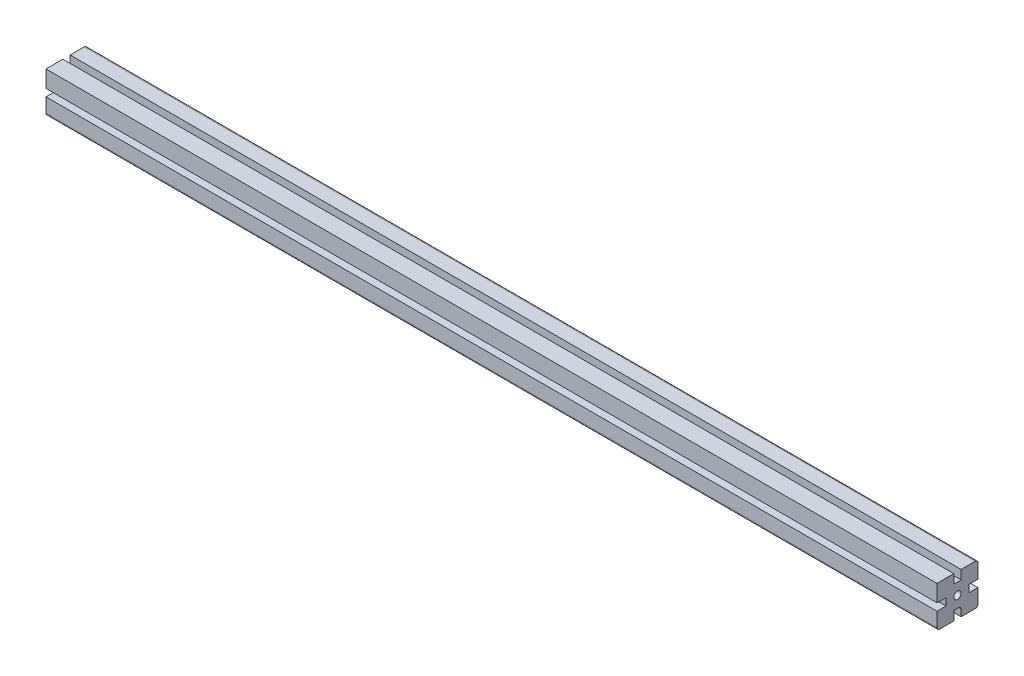
ISO-10303-21;
HEADER;
FILE_DESCRIPTION(('STEP AP214'),'2;1');
FILE_NAME('part.step','',(''),(''),'','','');
FILE_SCHEMA(('AUTOMOTIVE_DESIGN { 1 0 10303 214 1 1 1 1 }'));
ENDSEC;
DATA;
#1=APPLICATION_CONTEXT('core data for automotive mechanical design processes');
#2=APPLICATION_PROTOCOL_DEFINITION('international standard','automotive_design',2000,#1);
#3=PRODUCT_CONTEXT('',#1,'mechanical');
#4=PRODUCT('Part','Part','',(#3));
#5=PRODUCT_RELATED_PRODUCT_CATEGORY('part','',(#4));
#6=PRODUCT_DEFINITION_FORMATION('','',#4);
#7=PRODUCT_DEFINITION_CONTEXT('part definition',#1,'design');
#8=PRODUCT_DEFINITION('design','',#6,#7);
#9=PRODUCT_DEFINITION_SHAPE('','',#8);
#10=(LENGTH_UNIT() NAMED_UNIT(*) SI_UNIT(.MILLI.,.METRE.));
#11=(NAMED_UNIT(*) PLANE_ANGLE_UNIT() SI_UNIT($,.RADIAN.));
#12=(NAMED_UNIT(*) SI_UNIT($,.STERADIAN.) SOLID_ANGLE_UNIT());
#13=UNCERTAINTY_MEASURE_WITH_UNIT(LENGTH_MEASURE(1.E-05),#10,'distance_accuracy_value','');
#14=(GEOMETRIC_REPRESENTATION_CONTEXT(3) GLOBAL_UNCERTAINTY_ASSIGNED_CONTEXT((#13)) GLOBAL_UNIT_ASSIGNED_CONTEXT((#10,
#11,#12)) REPRESENTATION_CONTEXT('',''));
#15=CARTESIAN_POINT('',(0.,0.,0.));
#16=DIRECTION('',(0.,0.,1.));
#17=DIRECTION('',(1.,0.,0.));
#18=AXIS2_PLACEMENT_3D('',#15,#16,#17);
#19=CARTESIAN_POINT('',(22.,-22.5,-22.5));
#20=DIRECTION('',(0.,0.,-1.));
#21=DIRECTION('',(0.,1.,0.));
#22=AXIS2_PLACEMENT_3D('',#19,#20,#21);
#23=PLANE('',#22);
#24=DIRECTION('',(0.,1.,0.));
#25=VECTOR('',#24,1.);
#26=CARTESIAN_POINT('',(1000.,-22.5,-22.5));
#27=LINE('',#26,#25);
#28=CARTESIAN_POINT('',(1000.,-19.5,-22.5));
#29=VERTEX_POINT('',#28);
#30=CARTESIAN_POINT('',(1000.,-4.,-22.5));
#31=VERTEX_POINT('',#30);
#32=EDGE_CURVE('E270',#29,#31,#27,.T.);
#33=ORIENTED_EDGE('',*,*,#32,.F.);
#34=DIRECTION('',(1.,0.,0.));
#35=VECTOR('',#34,1.);
#36=CARTESIAN_POINT('',(22.,-19.5,-22.5));
#37=LINE('',#36,#35);
#38=CARTESIAN_POINT('',(22.,-19.5,-22.5));
#39=VERTEX_POINT('',#38);
#40=EDGE_CURVE('E201',#29,#39,#37,.F.);
#41=ORIENTED_EDGE('',*,*,#40,.T.);
#42=DIRECTION('',(0.,1.,0.));
#43=VECTOR('',#42,1.);
#44=CARTESIAN_POINT('',(22.,-22.5,-22.5));
#45=LINE('',#44,#43);
#46=CARTESIAN_POINT('',(22.,-4.,-22.5));
#47=VERTEX_POINT('',#46);
#48=EDGE_CURVE('E195',#39,#47,#45,.T.);
#49=ORIENTED_EDGE('',*,*,#48,.T.);
#50=DIRECTION('',(1.,0.,0.));
#51=VECTOR('',#50,1.);
#52=CARTESIAN_POINT('',(22.,-4.,-22.5));
#53=LINE('',#52,#51);
#54=EDGE_CURVE('E198',#47,#31,#53,.T.);
#55=ORIENTED_EDGE('',*,*,#54,.T.);
#56=EDGE_LOOP('',(#33,#41,#49,#55));
#57=FACE_BOUND('',#56,.T.);
#58=ADVANCED_FACE('F33',(#57),#23,.T.);
#59=CARTESIAN_POINT('',(22.,-22.5,-4.00000000000001));
#60=DIRECTION('',(0.,-1.,0.));
#61=DIRECTION('',(0.,0.,-1.));
#62=AXIS2_PLACEMENT_3D('',#59,#60,#61);
#63=PLANE('',#62);
#64=DIRECTION('',(0.,0.,-1.));
#65=VECTOR('',#64,1.);
#66=CARTESIAN_POINT('',(22.,-22.5,-4.00000000000001));
#67=LINE('',#66,#65);
#68=CARTESIAN_POINT('',(22.,-22.5,-4.00000000000001));
#69=VERTEX_POINT('',#68);
#70=CARTESIAN_POINT('',(22.,-22.5,-19.5));
#71=VERTEX_POINT('',#70);
#72=EDGE_CURVE('E213',#69,#71,#67,.T.);
#73=ORIENTED_EDGE('',*,*,#72,.T.);
#74=DIRECTION('',(1.,0.,0.));
#75=VECTOR('',#74,1.);
#76=CARTESIAN_POINT('',(22.,-22.5,-19.5));
#77=LINE('',#76,#75);
#78=CARTESIAN_POINT('',(1000.,-22.5,-19.5));
#79=VERTEX_POINT('',#78);
#80=EDGE_CURVE('E327',#71,#79,#77,.T.);
#81=ORIENTED_EDGE('',*,*,#80,.T.);
#82=DIRECTION('',(0.,0.,-1.));
#83=VECTOR('',#82,1.);
#84=CARTESIAN_POINT('',(1000.,-22.5,-4.00000000000001));
#85=LINE('',#84,#83);
#86=CARTESIAN_POINT('',(1000.,-22.5,-4.00000000000001));
#87=VERTEX_POINT('',#86);
#88=EDGE_CURVE('E205',#87,#79,#85,.T.);
#89=ORIENTED_EDGE('',*,*,#88,.F.);
#90=DIRECTION('',(1.,0.,0.));
#91=VECTOR('',#90,1.);
#92=CARTESIAN_POINT('',(22.,-22.5,-4.00000000000001));
#93=LINE('',#92,#91);
#94=EDGE_CURVE('E324',#69,#87,#93,.T.);
#95=ORIENTED_EDGE('',*,*,#94,.F.);
#96=EDGE_LOOP('',(#73,#81,#89,#95));
#97=FACE_BOUND('',#96,.T.);
#98=ADVANCED_FACE('F468',(#97),#63,.T.);
#99=CARTESIAN_POINT('',(22.,-12.5,-4.));
#100=DIRECTION('',(0.,0.,1.));
#101=DIRECTION('',(0.,-1.,0.));
#102=AXIS2_PLACEMENT_3D('',#99,#100,#101);
#103=PLANE('',#102);
#104=DIRECTION('',(0.,-1.,0.));
#105=VECTOR('',#104,1.);
#106=CARTESIAN_POINT('',(1000.,-12.5,-4.));
#107=LINE('',#106,#105);
#108=CARTESIAN_POINT('',(1000.,-15.5,-4.));
#109=VERTEX_POINT('',#108);
#110=EDGE_CURVE('E320',#109,#87,#107,.T.);
#111=ORIENTED_EDGE('',*,*,#110,.F.);
#112=DIRECTION('',(1.,0.,0.));
#113=VECTOR('',#112,1.);
#114=CARTESIAN_POINT('',(22.,-15.5,-4.));
#115=LINE('',#114,#113);
#116=CARTESIAN_POINT('',(22.,-15.5,-4.));
#117=VERTEX_POINT('',#116);
#118=EDGE_CURVE('E383',#109,#117,#115,.F.);
#119=ORIENTED_EDGE('',*,*,#118,.T.);
#120=DIRECTION('',(0.,-1.,0.));
#121=VECTOR('',#120,1.);
#122=CARTESIAN_POINT('',(22.,-12.5,-4.));
#123=LINE('',#122,#121);
#124=EDGE_CURVE('E266',#117,#69,#123,.T.);
#125=ORIENTED_EDGE('',*,*,#124,.T.);
#126=ORIENTED_EDGE('',*,*,#94,.T.);
#127=EDGE_LOOP('',(#111,#119,#125,#126));
#128=FACE_BOUND('',#127,.T.);
#129=ADVANCED_FACE('F392',(#128),#103,.T.);
#130=CARTESIAN_POINT('',(22.,-12.5,4.));
#131=DIRECTION('',(0.,-1.,0.));
#132=DIRECTION('',(0.,0.,-1.));
#133=AXIS2_PLACEMENT_3D('',#130,#131,#132);
#134=PLANE('',#133);
#135=DIRECTION('',(0.,0.,-1.));
#136=VECTOR('',#135,1.);
#137=CARTESIAN_POINT('',(22.,-12.5,4.));
#138=LINE('',#137,#136);
#139=CARTESIAN_POINT('',(22.,-12.5,4.));
#140=VERTEX_POINT('',#139);
#141=CARTESIAN_POINT('',(22.,-12.5,-1.));
#142=VERTEX_POINT('',#141);
#143=EDGE_CURVE('E263',#140,#142,#138,.T.);
#144=ORIENTED_EDGE('',*,*,#143,.T.);
#145=DIRECTION('',(1.,0.,0.));
#146=VECTOR('',#145,1.);
#147=CARTESIAN_POINT('',(1000.,-12.5,-1.));
#148=LINE('',#147,#146);
#149=CARTESIAN_POINT('',(1000.,-12.5,-1.));
#150=VERTEX_POINT('',#149);
#151=EDGE_CURVE('E380',#142,#150,#148,.T.);
#152=ORIENTED_EDGE('',*,*,#151,.T.);
#153=DIRECTION('',(0.,0.,-1.));
#154=VECTOR('',#153,1.);
#155=CARTESIAN_POINT('',(1000.,-12.5,4.));
#156=LINE('',#155,#154);
#157=CARTESIAN_POINT('',(1000.,-12.5,4.));
#158=VERTEX_POINT('',#157);
#159=EDGE_CURVE('E317',#158,#150,#156,.T.);
#160=ORIENTED_EDGE('',*,*,#159,.F.);
#161=DIRECTION('',(1.,0.,0.));
#162=VECTOR('',#161,1.);
#163=CARTESIAN_POINT('',(22.,-12.5,4.));
#164=LINE('',#163,#162);
#165=EDGE_CURVE('E328',#140,#158,#164,.T.);
#166=ORIENTED_EDGE('',*,*,#165,.F.);
#167=EDGE_LOOP('',(#144,#152,#160,#166));
#168=FACE_BOUND('',#167,.T.);
#169=ADVANCED_FACE('F401',(#168),#134,.T.);
#170=CARTESIAN_POINT('',(22.,-22.5,4.00000000000001));
#171=DIRECTION('',(0.,0.,-1.));
#172=DIRECTION('',(0.,1.,0.));
#173=AXIS2_PLACEMENT_3D('',#170,#171,#172);
#174=PLANE('',#173);
#175=DIRECTION('',(0.,1.,0.));
#176=VECTOR('',#175,1.);
#177=CARTESIAN_POINT('',(1000.,-22.5,4.00000000000001));
#178=LINE('',#177,#176);
#179=CARTESIAN_POINT('',(1000.,-22.5,4.00000000000001));
#180=VERTEX_POINT('',#179);
#181=EDGE_CURVE('E314',#180,#158,#178,.T.);
#182=ORIENTED_EDGE('',*,*,#181,.F.);
#183=DIRECTION('',(1.,0.,0.));
#184=VECTOR('',#183,1.);
#185=CARTESIAN_POINT('',(22.,-22.5,4.00000000000001));
#186=LINE('',#185,#184);
#187=CARTESIAN_POINT('',(22.,-22.5,4.00000000000001));
#188=VERTEX_POINT('',#187);
#189=EDGE_CURVE('E330',#188,#180,#186,.T.);
#190=ORIENTED_EDGE('',*,*,#189,.F.);
#191=DIRECTION('',(0.,1.,0.));
#192=VECTOR('',#191,1.);
#193=CARTESIAN_POINT('',(22.,-22.5,4.00000000000001));
#194=LINE('',#193,#192);
#195=EDGE_CURVE('E260',#188,#140,#194,.T.);
#196=ORIENTED_EDGE('',*,*,#195,.T.);
#197=ORIENTED_EDGE('',*,*,#165,.T.);
#198=EDGE_LOOP('',(#182,#190,#196,#197));
#199=FACE_BOUND('',#198,.T.);
#200=ADVANCED_FACE('F404',(#199),#174,.T.);
#201=CARTESIAN_POINT('',(22.,-22.5,22.5));
#202=DIRECTION('',(0.,-1.,0.));
#203=DIRECTION('',(0.,0.,-1.));
#204=AXIS2_PLACEMENT_3D('',#201,#202,#203);
#205=PLANE('',#204);
#206=DIRECTION('',(0.,0.,-1.));
#207=VECTOR('',#206,1.);
#208=CARTESIAN_POINT('',(1000.,-22.5,22.5));
#209=LINE('',#208,#207);
#210=CARTESIAN_POINT('',(1000.,-22.5,19.5));
#211=VERTEX_POINT('',#210);
#212=EDGE_CURVE('E312',#211,#180,#209,.T.);
#213=ORIENTED_EDGE('',*,*,#212,.F.);
#214=DIRECTION('',(1.,0.,0.));
#215=VECTOR('',#214,1.);
#216=CARTESIAN_POINT('',(22.,-22.5,19.5));
#217=LINE('',#216,#215);
#218=CARTESIAN_POINT('',(22.,-22.5,19.5));
#219=VERTEX_POINT('',#218);
#220=EDGE_CURVE('E374',#211,#219,#217,.F.);
#221=ORIENTED_EDGE('',*,*,#220,.T.);
#222=DIRECTION('',(0.,0.,-1.));
#223=VECTOR('',#222,1.);
#224=CARTESIAN_POINT('',(22.,-22.5,22.5));
#225=LINE('',#224,#223);
#226=EDGE_CURVE('E258',#219,#188,#225,.T.);
#227=ORIENTED_EDGE('',*,*,#226,.T.);
#228=ORIENTED_EDGE('',*,*,#189,.T.);
#229=EDGE_LOOP('',(#213,#221,#227,#228));
#230=FACE_BOUND('',#229,.T.);
#231=ADVANCED_FACE('F484',(#230),#205,.T.);
#232=CARTESIAN_POINT('',(22.,-4.,22.5));
#233=DIRECTION('',(0.,0.,1.));
#234=DIRECTION('',(0.,-1.,0.));
#235=AXIS2_PLACEMENT_3D('',#232,#233,#234);
#236=PLANE('',#235);
#237=DIRECTION('',(0.,-1.,0.));
#238=VECTOR('',#237,1.);
#239=CARTESIAN_POINT('',(22.,-4.,22.5));
#240=LINE('',#239,#238);
#241=CARTESIAN_POINT('',(22.,-4.,22.5));
#242=VERTEX_POINT('',#241);
#243=CARTESIAN_POINT('',(22.,-19.5,22.5));
#244=VERTEX_POINT('',#243);
#245=EDGE_CURVE('E255',#242,#244,#240,.T.);
#246=ORIENTED_EDGE('',*,*,#245,.T.);
#247=DIRECTION('',(1.,0.,0.));
#248=VECTOR('',#247,1.);
#249=CARTESIAN_POINT('',(22.,-19.5,22.5));
#250=LINE('',#249,#248);
#251=CARTESIAN_POINT('',(1000.,-19.5,22.5));
#252=VERTEX_POINT('',#251);
#253=EDGE_CURVE('E371',#244,#252,#250,.T.);
#254=ORIENTED_EDGE('',*,*,#253,.T.);
#255=DIRECTION('',(0.,-1.,0.));
#256=VECTOR('',#255,1.);
#257=CARTESIAN_POINT('',(1000.,-4.,22.5));
#258=LINE('',#257,#256);
#259=CARTESIAN_POINT('',(1000.,-4.,22.5));
#260=VERTEX_POINT('',#259);
#261=EDGE_CURVE('E309',#260,#252,#258,.T.);
#262=ORIENTED_EDGE('',*,*,#261,.F.);
#263=DIRECTION('',(1.,0.,0.));
#264=VECTOR('',#263,1.);
#265=CARTESIAN_POINT('',(22.,-4.,22.5));
#266=LINE('',#265,#264);
#267=EDGE_CURVE('E333',#242,#260,#266,.T.);
#268=ORIENTED_EDGE('',*,*,#267,.F.);
#269=EDGE_LOOP('',(#246,#254,#262,#268));
#270=FACE_BOUND('',#269,.T.);
#271=ADVANCED_FACE('F416',(#270),#236,.T.);
#272=CARTESIAN_POINT('',(22.,-4.,12.5));
#273=DIRECTION('',(0.,1.,0.));
#274=DIRECTION('',(0.,0.,1.));
#275=AXIS2_PLACEMENT_3D('',#272,#273,#274);
#276=PLANE('',#275);
#277=DIRECTION('',(0.,0.,1.));
#278=VECTOR('',#277,1.);
#279=CARTESIAN_POINT('',(1000.,-4.,12.5));
#280=LINE('',#279,#278);
#281=CARTESIAN_POINT('',(1000.,-4.,12.5));
#282=VERTEX_POINT('',#281);
#283=EDGE_CURVE('E306',#282,#260,#280,.T.);
#284=ORIENTED_EDGE('',*,*,#283,.F.);
#285=DIRECTION('',(1.,0.,0.));
#286=VECTOR('',#285,1.);
#287=CARTESIAN_POINT('',(22.,-4.,12.5));
#288=LINE('',#287,#286);
#289=CARTESIAN_POINT('',(22.,-4.,12.5));
#290=VERTEX_POINT('',#289);
#291=EDGE_CURVE('E335',#290,#282,#288,.T.);
#292=ORIENTED_EDGE('',*,*,#291,.F.);
#293=DIRECTION('',(0.,0.,1.));
#294=VECTOR('',#293,1.);
#295=CARTESIAN_POINT('',(22.,-4.,12.5));
#296=LINE('',#295,#294);
#297=EDGE_CURVE('E252',#290,#242,#296,.T.);
#298=ORIENTED_EDGE('',*,*,#297,.T.);
#299=ORIENTED_EDGE('',*,*,#267,.T.);
#300=EDGE_LOOP('',(#284,#292,#298,#299));
#301=FACE_BOUND('',#300,.T.);
#302=ADVANCED_FACE('F421',(#301),#276,.T.);
#303=CARTESIAN_POINT('',(22.,4.,12.5));
#304=DIRECTION('',(0.,0.,1.));
#305=DIRECTION('',(1.,0.,0.));
#306=AXIS2_PLACEMENT_3D('',#303,#304,#305);
#307=PLANE('',#306);
#308=DIRECTION('',(0.,-1.,0.));
#309=VECTOR('',#308,1.);
#310=CARTESIAN_POINT('',(1000.,4.,12.5));
#311=LINE('',#310,#309);
#312=CARTESIAN_POINT('',(1000.,4.,12.5));
#313=VERTEX_POINT('',#312);
#314=EDGE_CURVE('E303',#313,#282,#311,.T.);
#315=ORIENTED_EDGE('',*,*,#314,.F.);
#316=DIRECTION('',(1.,0.,0.));
#317=VECTOR('',#316,1.);
#318=CARTESIAN_POINT('',(22.,4.,12.5));
#319=LINE('',#318,#317);
#320=CARTESIAN_POINT('',(22.,4.,12.5));
#321=VERTEX_POINT('',#320);
#322=EDGE_CURVE('E337',#321,#313,#319,.T.);
#323=ORIENTED_EDGE('',*,*,#322,.F.);
#324=DIRECTION('',(0.,-1.,0.));
#325=VECTOR('',#324,1.);
#326=CARTESIAN_POINT('',(22.,4.,12.5));
#327=LINE('',#326,#325);
#328=EDGE_CURVE('E249',#321,#290,#327,.T.);
#329=ORIENTED_EDGE('',*,*,#328,.T.);
#330=ORIENTED_EDGE('',*,*,#291,.T.);
#331=EDGE_LOOP('',(#315,#323,#329,#330));
#332=FACE_BOUND('',#331,.T.);
#333=ADVANCED_FACE('F426',(#332),#307,.T.);
#334=CARTESIAN_POINT('',(22.,4.,22.5));
#335=DIRECTION('',(0.,-1.,0.));
#336=DIRECTION('',(0.,0.,-1.));
#337=AXIS2_PLACEMENT_3D('',#334,#335,#336);
#338=PLANE('',#337);
#339=DIRECTION('',(0.,0.,-1.));
#340=VECTOR('',#339,1.);
#341=CARTESIAN_POINT('',(1000.,4.,22.5));
#342=LINE('',#341,#340);
#343=CARTESIAN_POINT('',(1000.,4.,22.5));
#344=VERTEX_POINT('',#343);
#345=EDGE_CURVE('E300',#344,#313,#342,.T.);
#346=ORIENTED_EDGE('',*,*,#345,.F.);
#347=DIRECTION('',(1.,0.,0.));
#348=VECTOR('',#347,1.);
#349=CARTESIAN_POINT('',(22.,4.,22.5));
#350=LINE('',#349,#348);
#351=CARTESIAN_POINT('',(22.,4.,22.5));
#352=VERTEX_POINT('',#351);
#353=EDGE_CURVE('E339',#352,#344,#350,.T.);
#354=ORIENTED_EDGE('',*,*,#353,.F.);
#355=DIRECTION('',(0.,0.,-1.));
#356=VECTOR('',#355,1.);
#357=CARTESIAN_POINT('',(22.,4.,22.5));
#358=LINE('',#357,#356);
#359=EDGE_CURVE('E246',#352,#321,#358,.T.);
#360=ORIENTED_EDGE('',*,*,#359,.T.);
#361=ORIENTED_EDGE('',*,*,#322,.T.);
#362=EDGE_LOOP('',(#346,#354,#360,#361));
#363=FACE_BOUND('',#362,.T.);
#364=ADVANCED_FACE('F429',(#363),#338,.T.);
#365=CARTESIAN_POINT('',(22.,22.5,22.5));
#366=DIRECTION('',(0.,0.,1.));
#367=DIRECTION('',(0.,-1.,0.));
#368=AXIS2_PLACEMENT_3D('',#365,#366,#367);
#369=PLANE('',#368);
#370=DIRECTION('',(0.,-1.,0.));
#371=VECTOR('',#370,1.);
#372=CARTESIAN_POINT('',(1000.,22.5,22.5));
#373=LINE('',#372,#371);
#374=CARTESIAN_POINT('',(1000.,22.5,22.5));
#375=VERTEX_POINT('',#374);
#376=EDGE_CURVE('E297',#375,#344,#373,.T.);
#377=ORIENTED_EDGE('',*,*,#376,.F.);
#378=DIRECTION('',(1.,0.,0.));
#379=VECTOR('',#378,1.);
#380=CARTESIAN_POINT('',(22.,22.5,22.5));
#381=LINE('',#380,#379);
#382=CARTESIAN_POINT('',(22.,22.5,22.5));
#383=VERTEX_POINT('',#382);
#384=EDGE_CURVE('E341',#383,#375,#381,.T.);
#385=ORIENTED_EDGE('',*,*,#384,.F.);
#386=DIRECTION('',(0.,-1.,0.));
#387=VECTOR('',#386,1.);
#388=CARTESIAN_POINT('',(22.,22.5,22.5));
#389=LINE('',#388,#387);
#390=EDGE_CURVE('E243',#383,#352,#389,.T.);
#391=ORIENTED_EDGE('',*,*,#390,.T.);
#392=ORIENTED_EDGE('',*,*,#353,.T.);
#393=EDGE_LOOP('',(#377,#385,#391,#392));
#394=FACE_BOUND('',#393,.T.);
#395=ADVANCED_FACE('F434',(#394),#369,.T.);
#396=CARTESIAN_POINT('',(22.,22.5,4.));
#397=DIRECTION('',(0.,1.,0.));
#398=DIRECTION('',(0.,0.,1.));
#399=AXIS2_PLACEMENT_3D('',#396,#397,#398);
#400=PLANE('',#399);
#401=DIRECTION('',(0.,0.,1.));
#402=VECTOR('',#401,1.);
#403=CARTESIAN_POINT('',(1000.,22.5,4.));
#404=LINE('',#403,#402);
#405=CARTESIAN_POINT('',(1000.,22.5,4.));
#406=VERTEX_POINT('',#405);
#407=EDGE_CURVE('E294',#406,#375,#404,.T.);
#408=ORIENTED_EDGE('',*,*,#407,.F.);
#409=DIRECTION('',(1.,0.,0.));
#410=VECTOR('',#409,1.);
#411=CARTESIAN_POINT('',(22.,22.5,4.));
#412=LINE('',#411,#410);
#413=CARTESIAN_POINT('',(22.,22.5,4.));
#414=VERTEX_POINT('',#413);
#415=EDGE_CURVE('E343',#414,#406,#412,.T.);
#416=ORIENTED_EDGE('',*,*,#415,.F.);
#417=DIRECTION('',(0.,0.,1.));
#418=VECTOR('',#417,1.);
#419=CARTESIAN_POINT('',(22.,22.5,4.));
#420=LINE('',#419,#418);
#421=EDGE_CURVE('E240',#414,#383,#420,.T.);
#422=ORIENTED_EDGE('',*,*,#421,.T.);
#423=ORIENTED_EDGE('',*,*,#384,.T.);
#424=EDGE_LOOP('',(#408,#416,#422,#423));
#425=FACE_BOUND('',#424,.T.);
#426=ADVANCED_FACE('F437',(#425),#400,.T.);
#427=CARTESIAN_POINT('',(22.,12.5,4.));
#428=DIRECTION('',(0.,0.,-1.));
#429=DIRECTION('',(0.,1.,0.));
#430=AXIS2_PLACEMENT_3D('',#427,#428,#429);
#431=PLANE('',#430);
#432=DIRECTION('',(0.,1.,0.));
#433=VECTOR('',#432,1.);
#434=CARTESIAN_POINT('',(1000.,12.5,4.));
#435=LINE('',#434,#433);
#436=CARTESIAN_POINT('',(1000.,12.5,4.));
#437=VERTEX_POINT('',#436);
#438=EDGE_CURVE('E291',#437,#406,#435,.T.);
#439=ORIENTED_EDGE('',*,*,#438,.F.);
#440=DIRECTION('',(1.,0.,0.));
#441=VECTOR('',#440,1.);
#442=CARTESIAN_POINT('',(22.,12.5,4.));
#443=LINE('',#442,#441);
#444=CARTESIAN_POINT('',(22.,12.5,4.));
#445=VERTEX_POINT('',#444);
#446=EDGE_CURVE('E345',#445,#437,#443,.T.);
#447=ORIENTED_EDGE('',*,*,#446,.F.);
#448=DIRECTION('',(0.,1.,0.));
#449=VECTOR('',#448,1.);
#450=CARTESIAN_POINT('',(22.,12.5,4.));
#451=LINE('',#450,#449);
#452=EDGE_CURVE('E237',#445,#414,#451,.T.);
#453=ORIENTED_EDGE('',*,*,#452,.T.);
#454=ORIENTED_EDGE('',*,*,#415,.T.);
#455=EDGE_LOOP('',(#439,#447,#453,#454));
#456=FACE_BOUND('',#455,.T.);
#457=ADVANCED_FACE('F442',(#456),#431,.T.);
#458=CARTESIAN_POINT('',(22.,12.5,-4.));
#459=DIRECTION('',(0.,1.,0.));
#460=DIRECTION('',(0.,0.,1.));
#461=AXIS2_PLACEMENT_3D('',#458,#459,#460);
#462=PLANE('',#461);
#463=DIRECTION('',(0.,0.,1.));
#464=VECTOR('',#463,1.);
#465=CARTESIAN_POINT('',(1000.,12.5,-4.));
#466=LINE('',#465,#464);
#467=CARTESIAN_POINT('',(1000.,12.5,-4.));
#468=VERTEX_POINT('',#467);
#469=EDGE_CURVE('E288',#468,#437,#466,.T.);
#470=ORIENTED_EDGE('',*,*,#469,.F.);
#471=DIRECTION('',(1.,0.,0.));
#472=VECTOR('',#471,1.);
#473=CARTESIAN_POINT('',(22.,12.5,-4.));
#474=LINE('',#473,#472);
#475=CARTESIAN_POINT('',(22.,12.5,-4.));
#476=VERTEX_POINT('',#475);
#477=EDGE_CURVE('E347',#476,#468,#474,.T.);
#478=ORIENTED_EDGE('',*,*,#477,.F.);
#479=DIRECTION('',(0.,0.,1.));
#480=VECTOR('',#479,1.);
#481=CARTESIAN_POINT('',(22.,12.5,-4.));
#482=LINE('',#481,#480);
#483=EDGE_CURVE('E234',#476,#445,#482,.T.);
#484=ORIENTED_EDGE('',*,*,#483,.T.);
#485=ORIENTED_EDGE('',*,*,#446,.T.);
#486=EDGE_LOOP('',(#470,#478,#484,#485));
#487=FACE_BOUND('',#486,.T.);
#488=ADVANCED_FACE('F445',(#487),#462,.T.);
#489=CARTESIAN_POINT('',(22.,22.5,-4.));
#490=DIRECTION('',(0.,0.,1.));
#491=DIRECTION('',(0.,-1.,0.));
#492=AXIS2_PLACEMENT_3D('',#489,#490,#491);
#493=PLANE('',#492);
#494=DIRECTION('',(0.,-1.,0.));
#495=VECTOR('',#494,1.);
#496=CARTESIAN_POINT('',(1000.,22.5,-4.));
#497=LINE('',#496,#495);
#498=CARTESIAN_POINT('',(1000.,22.5,-4.));
#499=VERTEX_POINT('',#498);
#500=EDGE_CURVE('E285',#499,#468,#497,.T.);
#501=ORIENTED_EDGE('',*,*,#500,.F.);
#502=DIRECTION('',(1.,0.,0.));
#503=VECTOR('',#502,1.);
#504=CARTESIAN_POINT('',(22.,22.5,-4.));
#505=LINE('',#504,#503);
#506=CARTESIAN_POINT('',(22.,22.5,-4.));
#507=VERTEX_POINT('',#506);
#508=EDGE_CURVE('E349',#507,#499,#505,.T.);
#509=ORIENTED_EDGE('',*,*,#508,.F.);
#510=DIRECTION('',(0.,-1.,0.));
#511=VECTOR('',#510,1.);
#512=CARTESIAN_POINT('',(22.,22.5,-4.));
#513=LINE('',#512,#511);
#514=EDGE_CURVE('E231',#507,#476,#513,.T.);
#515=ORIENTED_EDGE('',*,*,#514,.T.);
#516=ORIENTED_EDGE('',*,*,#477,.T.);
#517=EDGE_LOOP('',(#501,#509,#515,#516));
#518=FACE_BOUND('',#517,.T.);
#519=ADVANCED_FACE('F450',(#518),#493,.T.);
#520=CARTESIAN_POINT('',(22.,22.5,-22.5));
#521=DIRECTION('',(0.,1.,0.));
#522=DIRECTION('',(0.,0.,1.));
#523=AXIS2_PLACEMENT_3D('',#520,#521,#522);
#524=PLANE('',#523);
#525=DIRECTION('',(0.,0.,1.));
#526=VECTOR('',#525,1.);
#527=CARTESIAN_POINT('',(1000.,22.5,-22.5));
#528=LINE('',#527,#526);
#529=CARTESIAN_POINT('',(1000.,22.5,-19.5));
#530=VERTEX_POINT('',#529);
#531=EDGE_CURVE('E283',#530,#499,#528,.T.);
#532=ORIENTED_EDGE('',*,*,#531,.F.);
#533=DIRECTION('',(1.,0.,0.));
#534=VECTOR('',#533,1.);
#535=CARTESIAN_POINT('',(22.,22.5,-19.5));
#536=LINE('',#535,#534);
#537=CARTESIAN_POINT('',(22.,22.5,-19.5));
#538=VERTEX_POINT('',#537);
#539=EDGE_CURVE('E56',#530,#538,#536,.F.);
#540=ORIENTED_EDGE('',*,*,#539,.T.);
#541=DIRECTION('',(0.,0.,1.));
#542=VECTOR('',#541,1.);
#543=CARTESIAN_POINT('',(22.,22.5,-22.5));
#544=LINE('',#543,#542);
#545=EDGE_CURVE('E229',#538,#507,#544,.T.);
#546=ORIENTED_EDGE('',*,*,#545,.T.);
#547=ORIENTED_EDGE('',*,*,#508,.T.);
#548=EDGE_LOOP('',(#532,#540,#546,#547));
#549=FACE_BOUND('',#548,.T.);
#550=ADVANCED_FACE('F451',(#549),#524,.T.);
#551=CARTESIAN_POINT('',(22.,4.,-22.5));
#552=DIRECTION('',(0.,0.,-1.));
#553=DIRECTION('',(0.,1.,0.));
#554=AXIS2_PLACEMENT_3D('',#551,#552,#553);
#555=PLANE('',#554);
#556=DIRECTION('',(0.,1.,0.));
#557=VECTOR('',#556,1.);
#558=CARTESIAN_POINT('',(22.,4.,-22.5));
#559=LINE('',#558,#557);
#560=CARTESIAN_POINT('',(22.,4.,-22.5));
#561=VERTEX_POINT('',#560);
#562=CARTESIAN_POINT('',(22.,19.5,-22.5));
#563=VERTEX_POINT('',#562);
#564=EDGE_CURVE('E227',#561,#563,#559,.T.);
#565=ORIENTED_EDGE('',*,*,#564,.T.);
#566=DIRECTION('',(1.,0.,0.));
#567=VECTOR('',#566,1.);
#568=CARTESIAN_POINT('',(22.,19.5,-22.5));
#569=LINE('',#568,#567);
#570=CARTESIAN_POINT('',(1000.,19.5,-22.5));
#571=VERTEX_POINT('',#570);
#572=EDGE_CURVE('E376',#563,#571,#569,.T.);
#573=ORIENTED_EDGE('',*,*,#572,.T.);
#574=DIRECTION('',(0.,1.,0.));
#575=VECTOR('',#574,1.);
#576=CARTESIAN_POINT('',(1000.,4.,-22.5));
#577=LINE('',#576,#575);
#578=CARTESIAN_POINT('',(1000.,4.,-22.5));
#579=VERTEX_POINT('',#578);
#580=EDGE_CURVE('E280',#579,#571,#577,.T.);
#581=ORIENTED_EDGE('',*,*,#580,.F.);
#582=DIRECTION('',(1.,0.,0.));
#583=VECTOR('',#582,1.);
#584=CARTESIAN_POINT('',(22.,4.,-22.5));
#585=LINE('',#584,#583);
#586=EDGE_CURVE('E352',#561,#579,#585,.T.);
#587=ORIENTED_EDGE('',*,*,#586,.F.);
#588=EDGE_LOOP('',(#565,#573,#581,#587));
#589=FACE_BOUND('',#588,.T.);
#590=ADVANCED_FACE('F457',(#589),#555,.T.);
#591=CARTESIAN_POINT('',(22.,4.,-12.5));
#592=DIRECTION('',(0.,-1.,0.));
#593=DIRECTION('',(0.,0.,-1.));
#594=AXIS2_PLACEMENT_3D('',#591,#592,#593);
#595=PLANE('',#594);
#596=DIRECTION('',(0.,0.,-1.));
#597=VECTOR('',#596,1.);
#598=CARTESIAN_POINT('',(1000.,4.,-12.5));
#599=LINE('',#598,#597);
#600=CARTESIAN_POINT('',(1000.,4.,-12.5));
#601=VERTEX_POINT('',#600);
#602=EDGE_CURVE('E277',#601,#579,#599,.T.);
#603=ORIENTED_EDGE('',*,*,#602,.F.);
#604=DIRECTION('',(1.,0.,0.));
#605=VECTOR('',#604,1.);
#606=CARTESIAN_POINT('',(22.,4.,-12.5));
#607=LINE('',#606,#605);
#608=CARTESIAN_POINT('',(22.,4.,-12.5));
#609=VERTEX_POINT('',#608);
#610=EDGE_CURVE('E354',#609,#601,#607,.T.);
#611=ORIENTED_EDGE('',*,*,#610,.F.);
#612=DIRECTION('',(0.,0.,-1.));
#613=VECTOR('',#612,1.);
#614=CARTESIAN_POINT('',(22.,4.,-12.5));
#615=LINE('',#614,#613);
#616=EDGE_CURVE('E221',#609,#561,#615,.T.);
#617=ORIENTED_EDGE('',*,*,#616,.T.);
#618=ORIENTED_EDGE('',*,*,#586,.T.);
#619=EDGE_LOOP('',(#603,#611,#617,#618));
#620=FACE_BOUND('',#619,.T.);
#621=ADVANCED_FACE('F461',(#620),#595,.T.);
#622=CARTESIAN_POINT('',(22.,-4.,-12.5));
#623=DIRECTION('',(0.,0.,-1.));
#624=DIRECTION('',(-1.,0.,0.));
#625=AXIS2_PLACEMENT_3D('',#622,#623,#624);
#626=PLANE('',#625);
#627=DIRECTION('',(0.,1.,0.));
#628=VECTOR('',#627,1.);
#629=CARTESIAN_POINT('',(1000.,-4.,-12.5));
#630=LINE('',#629,#628);
#631=CARTESIAN_POINT('',(1000.,-4.,-12.5));
#632=VERTEX_POINT('',#631);
#633=EDGE_CURVE('E274',#632,#601,#630,.T.);
#634=ORIENTED_EDGE('',*,*,#633,.F.);
#635=DIRECTION('',(1.,0.,0.));
#636=VECTOR('',#635,1.);
#637=CARTESIAN_POINT('',(22.,-4.,-12.5));
#638=LINE('',#637,#636);
#639=CARTESIAN_POINT('',(22.,-4.,-12.5));
#640=VERTEX_POINT('',#639);
#641=EDGE_CURVE('E212',#640,#632,#638,.T.);
#642=ORIENTED_EDGE('',*,*,#641,.F.);
#643=DIRECTION('',(0.,1.,0.));
#644=VECTOR('',#643,1.);
#645=CARTESIAN_POINT('',(22.,-4.,-12.5));
#646=LINE('',#645,#644);
#647=EDGE_CURVE('E219',#640,#609,#646,.T.);
#648=ORIENTED_EDGE('',*,*,#647,.T.);
#649=ORIENTED_EDGE('',*,*,#610,.T.);
#650=EDGE_LOOP('',(#634,#642,#648,#649));
#651=FACE_BOUND('',#650,.T.);
#652=ADVANCED_FACE('F463',(#651),#626,.T.);
#653=CARTESIAN_POINT('',(22.,-4.,-22.5));
#654=DIRECTION('',(0.,1.,0.));
#655=DIRECTION('',(0.,0.,1.));
#656=AXIS2_PLACEMENT_3D('',#653,#654,#655);
#657=PLANE('',#656);
#658=DIRECTION('',(0.,0.,1.));
#659=VECTOR('',#658,1.);
#660=CARTESIAN_POINT('',(1000.,-4.,-22.5));
#661=LINE('',#660,#659);
#662=EDGE_CURVE('E211',#31,#632,#661,.T.);
#663=ORIENTED_EDGE('',*,*,#662,.F.);
#664=ORIENTED_EDGE('',*,*,#54,.F.);
#665=DIRECTION('',(0.,0.,1.));
#666=VECTOR('',#665,1.);
#667=CARTESIAN_POINT('',(22.,-4.,-22.5));
#668=LINE('',#667,#666);
#669=EDGE_CURVE('E204',#47,#640,#668,.T.);
#670=ORIENTED_EDGE('',*,*,#669,.T.);
#671=ORIENTED_EDGE('',*,*,#641,.T.);
#672=EDGE_LOOP('',(#663,#664,#670,#671));
#673=FACE_BOUND('',#672,.T.);
#674=ADVANCED_FACE('F209',(#673),#657,.T.);
#675=CARTESIAN_POINT('',(22.,0.,0.));
#676=DIRECTION('',(1.,0.,0.));
#677=DIRECTION('',(0.,0.,-1.));
#678=AXIS2_PLACEMENT_3D('',#675,#676,#677);
#679=PLANE('',#678);
#680=CARTESIAN_POINT('',(22.,0.,0.));
#681=DIRECTION('',(1.,0.,0.));
#682=DIRECTION('',(0.,0.,1.));
#683=AXIS2_PLACEMENT_3D('',#680,#681,#682);
#684=CIRCLE('',#683,4.);
#685=CARTESIAN_POINT('',(22.,0.,4.));
#686=VERTEX_POINT('',#685);
#687=EDGE_CURVE('E272',#686,#686,#684,.T.);
#688=ORIENTED_EDGE('',*,*,#687,.T.);
#689=EDGE_LOOP('',(#688));
#690=FACE_BOUND('',#689,.T.);
#691=ORIENTED_EDGE('',*,*,#48,.F.);
#692=CARTESIAN_POINT('',(22.,-19.5,-19.5));
#693=DIRECTION('',(1.,0.,0.));
#694=DIRECTION('',(0.,0.,-1.));
#695=AXIS2_PLACEMENT_3D('',#692,#693,#694);
#696=CIRCLE('',#695,3.);
#697=EDGE_CURVE('E369',#39,#71,#696,.F.);
#698=ORIENTED_EDGE('',*,*,#697,.T.);
#699=ORIENTED_EDGE('',*,*,#72,.F.);
#700=ORIENTED_EDGE('',*,*,#124,.F.);
#701=CARTESIAN_POINT('',(22.,-15.5,-1.));
#702=DIRECTION('',(1.,0.,0.));
#703=DIRECTION('',(0.,0.,-1.));
#704=AXIS2_PLACEMENT_3D('',#701,#702,#703);
#705=CIRCLE('',#704,3.);
#706=EDGE_CURVE('E11',#117,#142,#705,.T.);
#707=ORIENTED_EDGE('',*,*,#706,.T.);
#708=ORIENTED_EDGE('',*,*,#143,.F.);
#709=ORIENTED_EDGE('',*,*,#195,.F.);
#710=ORIENTED_EDGE('',*,*,#226,.F.);
#711=CARTESIAN_POINT('',(22.,-19.5,19.5));
#712=DIRECTION('',(1.,0.,0.));
#713=DIRECTION('',(0.,0.,-1.));
#714=AXIS2_PLACEMENT_3D('',#711,#712,#713);
#715=CIRCLE('',#714,3.);
#716=EDGE_CURVE('E367',#219,#244,#715,.F.);
#717=ORIENTED_EDGE('',*,*,#716,.T.);
#718=ORIENTED_EDGE('',*,*,#245,.F.);
#719=ORIENTED_EDGE('',*,*,#297,.F.);
#720=ORIENTED_EDGE('',*,*,#328,.F.);
#721=ORIENTED_EDGE('',*,*,#359,.F.);
#722=ORIENTED_EDGE('',*,*,#390,.F.);
#723=ORIENTED_EDGE('',*,*,#421,.F.);
#724=ORIENTED_EDGE('',*,*,#452,.F.);
#725=ORIENTED_EDGE('',*,*,#483,.F.);
#726=ORIENTED_EDGE('',*,*,#514,.F.);
#727=ORIENTED_EDGE('',*,*,#545,.F.);
#728=CARTESIAN_POINT('',(22.,19.5,-19.5));
#729=DIRECTION('',(1.,0.,0.));
#730=DIRECTION('',(0.,0.,-1.));
#731=AXIS2_PLACEMENT_3D('',#728,#729,#730);
#732=CIRCLE('',#731,3.);
#733=EDGE_CURVE('E48',#538,#563,#732,.F.);
#734=ORIENTED_EDGE('',*,*,#733,.T.);
#735=ORIENTED_EDGE('',*,*,#564,.F.);
#736=ORIENTED_EDGE('',*,*,#616,.F.);
#737=ORIENTED_EDGE('',*,*,#647,.F.);
#738=ORIENTED_EDGE('',*,*,#669,.F.);
#739=EDGE_LOOP('',(#691,#698,#699,#700,#707,#708,#709,#710,#717,#718,#719,#720,#721,#722,#723,
#724,#725,#726,#727,#734,#735,#736,#737,#738));
#740=FACE_BOUND('',#739,.T.);
#741=ADVANCED_FACE('F216',(#690,#740),#679,.F.);
#742=CARTESIAN_POINT('',(1000.,0.,0.));
#743=DIRECTION('',(1.,0.,0.));
#744=DIRECTION('',(0.,0.,-1.));
#745=AXIS2_PLACEMENT_3D('',#742,#743,#744);
#746=PLANE('',#745);
#747=CARTESIAN_POINT('',(1000.,0.,0.));
#748=DIRECTION('',(1.,0.,0.));
#749=DIRECTION('',(0.,0.,1.));
#750=AXIS2_PLACEMENT_3D('',#747,#748,#749);
#751=CIRCLE('',#750,4.);
#752=CARTESIAN_POINT('',(1000.,0.,4.));
#753=VERTEX_POINT('',#752);
#754=EDGE_CURVE('E693',#753,#753,#751,.T.);
#755=ORIENTED_EDGE('',*,*,#754,.F.);
#756=EDGE_LOOP('',(#755));
#757=FACE_BOUND('',#756,.T.);
#758=ORIENTED_EDGE('',*,*,#88,.T.);
#759=CARTESIAN_POINT('',(1000.,-19.5,-19.5));
#760=DIRECTION('',(1.,0.,0.));
#761=DIRECTION('',(0.,0.,-1.));
#762=AXIS2_PLACEMENT_3D('',#759,#760,#761);
#763=CIRCLE('',#762,3.);
#764=EDGE_CURVE('E363',#79,#29,#763,.T.);
#765=ORIENTED_EDGE('',*,*,#764,.T.);
#766=ORIENTED_EDGE('',*,*,#32,.T.);
#767=ORIENTED_EDGE('',*,*,#662,.T.);
#768=ORIENTED_EDGE('',*,*,#633,.T.);
#769=ORIENTED_EDGE('',*,*,#602,.T.);
#770=ORIENTED_EDGE('',*,*,#580,.T.);
#771=CARTESIAN_POINT('',(1000.,19.5,-19.5));
#772=DIRECTION('',(1.,0.,0.));
#773=DIRECTION('',(0.,0.,-1.));
#774=AXIS2_PLACEMENT_3D('',#771,#772,#773);
#775=CIRCLE('',#774,3.);
#776=EDGE_CURVE('E359',#571,#530,#775,.T.);
#777=ORIENTED_EDGE('',*,*,#776,.T.);
#778=ORIENTED_EDGE('',*,*,#531,.T.);
#779=ORIENTED_EDGE('',*,*,#500,.T.);
#780=ORIENTED_EDGE('',*,*,#469,.T.);
#781=ORIENTED_EDGE('',*,*,#438,.T.);
#782=ORIENTED_EDGE('',*,*,#407,.T.);
#783=ORIENTED_EDGE('',*,*,#376,.T.);
#784=ORIENTED_EDGE('',*,*,#345,.T.);
#785=ORIENTED_EDGE('',*,*,#314,.T.);
#786=ORIENTED_EDGE('',*,*,#283,.T.);
#787=ORIENTED_EDGE('',*,*,#261,.T.);
#788=CARTESIAN_POINT('',(1000.,-19.5,19.5));
#789=DIRECTION('',(1.,0.,0.));
#790=DIRECTION('',(0.,0.,-1.));
#791=AXIS2_PLACEMENT_3D('',#788,#789,#790);
#792=CIRCLE('',#791,3.);
#793=EDGE_CURVE('E361',#252,#211,#792,.T.);
#794=ORIENTED_EDGE('',*,*,#793,.T.);
#795=ORIENTED_EDGE('',*,*,#212,.T.);
#796=ORIENTED_EDGE('',*,*,#181,.T.);
#797=ORIENTED_EDGE('',*,*,#159,.T.);
#798=CARTESIAN_POINT('',(1000.,-15.5,-1.));
#799=DIRECTION('',(1.,0.,0.));
#800=DIRECTION('',(0.,0.,-1.));
#801=AXIS2_PLACEMENT_3D('',#798,#799,#800);
#802=CIRCLE('',#801,3.);
#803=EDGE_CURVE('E41',#150,#109,#802,.F.);
#804=ORIENTED_EDGE('',*,*,#803,.T.);
#805=ORIENTED_EDGE('',*,*,#110,.T.);
#806=EDGE_LOOP('',(#758,#765,#766,#767,#768,#769,#770,#777,#778,#779,#780,#781,#782,#783,#784,
#785,#786,#787,#794,#795,#796,#797,#804,#805));
#807=FACE_BOUND('',#806,.T.);
#808=ADVANCED_FACE('F386',(#757,#807),#746,.T.);
#809=CARTESIAN_POINT('',(22.,0.,0.));
#810=DIRECTION('',(1.,0.,0.));
#811=DIRECTION('',(0.,0.,-1.));
#812=AXIS2_PLACEMENT_3D('',#809,#810,#811);
#813=CYLINDRICAL_SURFACE('',#812,4.);
#814=ORIENTED_EDGE('',*,*,#687,.F.);
#815=EDGE_LOOP('',(#814));
#816=FACE_BOUND('',#815,.T.);
#817=ORIENTED_EDGE('',*,*,#754,.T.);
#818=EDGE_LOOP('',(#817));
#819=FACE_BOUND('',#818,.T.);
#820=ADVANCED_FACE('F517',(#816,#819),#813,.F.);
#821=CARTESIAN_POINT('',(22.,-19.5,-19.5));
#822=DIRECTION('',(1.,0.,0.));
#823=DIRECTION('',(0.,0.,-1.));
#824=AXIS2_PLACEMENT_3D('',#821,#822,#823);
#825=CYLINDRICAL_SURFACE('',#824,3.);
#826=ORIENTED_EDGE('',*,*,#697,.F.);
#827=ORIENTED_EDGE('',*,*,#40,.F.);
#828=ORIENTED_EDGE('',*,*,#764,.F.);
#829=ORIENTED_EDGE('',*,*,#80,.F.);
#830=EDGE_LOOP('',(#826,#827,#828,#829));
#831=FACE_BOUND('',#830,.T.);
#832=ADVANCED_FACE('F465',(#831),#825,.T.);
#833=CARTESIAN_POINT('',(22.,-19.5,19.5));
#834=DIRECTION('',(1.,0.,0.));
#835=DIRECTION('',(0.,0.,-1.));
#836=AXIS2_PLACEMENT_3D('',#833,#834,#835);
#837=CYLINDRICAL_SURFACE('',#836,3.);
#838=ORIENTED_EDGE('',*,*,#716,.F.);
#839=ORIENTED_EDGE('',*,*,#220,.F.);
#840=ORIENTED_EDGE('',*,*,#793,.F.);
#841=ORIENTED_EDGE('',*,*,#253,.F.);
#842=EDGE_LOOP('',(#838,#839,#840,#841));
#843=FACE_BOUND('',#842,.T.);
#844=ADVANCED_FACE('F413',(#843),#837,.T.);
#845=CARTESIAN_POINT('',(22.,19.5,-19.5));
#846=DIRECTION('',(1.,0.,0.));
#847=DIRECTION('',(0.,0.,-1.));
#848=AXIS2_PLACEMENT_3D('',#845,#846,#847);
#849=CYLINDRICAL_SURFACE('',#848,3.);
#850=ORIENTED_EDGE('',*,*,#733,.F.);
#851=ORIENTED_EDGE('',*,*,#539,.F.);
#852=ORIENTED_EDGE('',*,*,#776,.F.);
#853=ORIENTED_EDGE('',*,*,#572,.F.);
#854=EDGE_LOOP('',(#850,#851,#852,#853));
#855=FACE_BOUND('',#854,.T.);
#856=ADVANCED_FACE('F454',(#855),#849,.T.);
#857=CARTESIAN_POINT('',(22.,-15.5,-1.));
#858=DIRECTION('',(-1.,0.,0.));
#859=DIRECTION('',(0.,0.,1.));
#860=AXIS2_PLACEMENT_3D('',#857,#858,#859);
#861=CYLINDRICAL_SURFACE('',#860,3.);
#862=ORIENTED_EDGE('',*,*,#706,.F.);
#863=ORIENTED_EDGE('',*,*,#118,.F.);
#864=ORIENTED_EDGE('',*,*,#803,.F.);
#865=ORIENTED_EDGE('',*,*,#151,.F.);
#866=EDGE_LOOP('',(#862,#863,#864,#865));
#867=FACE_BOUND('',#866,.T.);
#868=ADVANCED_FACE('F35',(#867),#861,.F.);
#869=CLOSED_SHELL('',(#58,#98,#129,#169,#200,#231,#271,#302,#333,#364,#395,#426,#457,#488,#519,
#550,#590,#621,#652,#674,#741,#808,#820,#832,#844,#856,#868));
#870=MANIFOLD_SOLID_BREP('B2',#869);
#871=ADVANCED_BREP_SHAPE_REPRESENTATION('',(#18,#870),#14);
#872=SHAPE_DEFINITION_REPRESENTATION(#9,#871);
ENDSEC;
END-ISO-10303-21;
